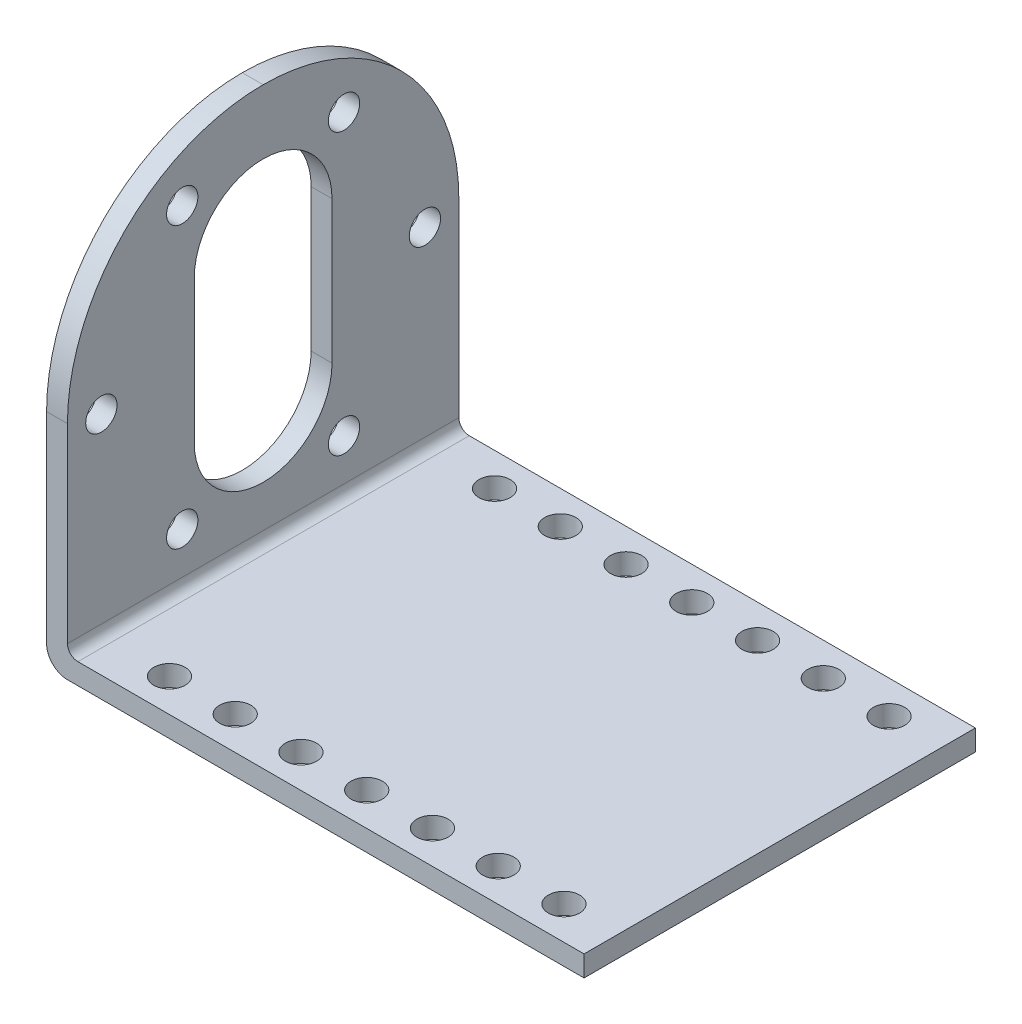
ISO-10303-21;
HEADER;
FILE_DESCRIPTION(('STEP AP214'),'2;1');
FILE_NAME('part.step','',(''),(''),'','','');
FILE_SCHEMA(('AUTOMOTIVE_DESIGN { 1 0 10303 214 1 1 1 1 }'));
ENDSEC;
DATA;
#1=APPLICATION_CONTEXT('core data for automotive mechanical design processes');
#2=APPLICATION_PROTOCOL_DEFINITION('international standard','automotive_design',2000,#1);
#3=PRODUCT_CONTEXT('',#1,'mechanical');
#4=PRODUCT('Part','Part','',(#3));
#5=PRODUCT_RELATED_PRODUCT_CATEGORY('part','',(#4));
#6=PRODUCT_DEFINITION_FORMATION('','',#4);
#7=PRODUCT_DEFINITION_CONTEXT('part definition',#1,'design');
#8=PRODUCT_DEFINITION('design','',#6,#7);
#9=PRODUCT_DEFINITION_SHAPE('','',#8);
#10=(LENGTH_UNIT() NAMED_UNIT(*) SI_UNIT(.MILLI.,.METRE.));
#11=(NAMED_UNIT(*) PLANE_ANGLE_UNIT() SI_UNIT($,.RADIAN.));
#12=(NAMED_UNIT(*) SI_UNIT($,.STERADIAN.) SOLID_ANGLE_UNIT());
#13=UNCERTAINTY_MEASURE_WITH_UNIT(LENGTH_MEASURE(1.E-05),#10,'distance_accuracy_value','');
#14=(GEOMETRIC_REPRESENTATION_CONTEXT(3) GLOBAL_UNCERTAINTY_ASSIGNED_CONTEXT((#13)) GLOBAL_UNIT_ASSIGNED_CONTEXT((#10,
#11,#12)) REPRESENTATION_CONTEXT('',''));
#15=CARTESIAN_POINT('',(0.,0.,0.));
#16=DIRECTION('',(0.,0.,1.));
#17=DIRECTION('',(1.,0.,0.));
#18=AXIS2_PLACEMENT_3D('',#15,#16,#17);
#19=CARTESIAN_POINT('',(-25.75,40.,18.75));
#20=DIRECTION('',(1.,0.,0.));
#21=DIRECTION('',(0.,0.,-1.));
#22=AXIS2_PLACEMENT_3D('',#19,#20,#21);
#23=PLANE('',#22);
#24=CARTESIAN_POINT('',(-25.75,33.8467875173176,-7.75));
#25=DIRECTION('',(-1.,0.,0.));
#26=DIRECTION('',(0.,0.,1.));
#27=AXIS2_PLACEMENT_3D('',#24,#25,#26);
#28=CIRCLE('',#27,1.49999999999999);
#29=CARTESIAN_POINT('',(-25.75,33.8467875173176,-6.25000000000001));
#30=VERTEX_POINT('',#29);
#31=EDGE_CURVE('E347',#30,#30,#28,.T.);
#32=ORIENTED_EDGE('',*,*,#31,.F.);
#33=EDGE_LOOP('',(#32));
#34=FACE_BOUND('',#33,.T.);
#35=CARTESIAN_POINT('',(-25.75,33.8467875173176,7.75000000000001));
#36=DIRECTION('',(-1.,0.,0.));
#37=DIRECTION('',(0.,0.,1.));
#38=AXIS2_PLACEMENT_3D('',#35,#36,#37);
#39=CIRCLE('',#38,1.49999999999999);
#40=CARTESIAN_POINT('',(-25.75,33.8467875173176,9.24999999999999));
#41=VERTEX_POINT('',#40);
#42=EDGE_CURVE('E341',#41,#41,#39,.T.);
#43=ORIENTED_EDGE('',*,*,#42,.F.);
#44=EDGE_LOOP('',(#43));
#45=FACE_BOUND('',#44,.T.);
#46=CARTESIAN_POINT('',(-25.75,20.4233937586588,15.5));
#47=DIRECTION('',(-1.,0.,0.));
#48=DIRECTION('',(0.,0.,1.));
#49=AXIS2_PLACEMENT_3D('',#46,#47,#48);
#50=CIRCLE('',#49,1.49999999999999);
#51=CARTESIAN_POINT('',(-25.75,20.4233937586588,17.));
#52=VERTEX_POINT('',#51);
#53=EDGE_CURVE('E335',#52,#52,#50,.T.);
#54=ORIENTED_EDGE('',*,*,#53,.F.);
#55=EDGE_LOOP('',(#54));
#56=FACE_BOUND('',#55,.T.);
#57=CARTESIAN_POINT('',(-25.75,6.99999999999999,7.75));
#58=DIRECTION('',(-1.,0.,0.));
#59=DIRECTION('',(0.,0.,1.));
#60=AXIS2_PLACEMENT_3D('',#57,#58,#59);
#61=CIRCLE('',#60,1.49999999999999);
#62=CARTESIAN_POINT('',(-25.75,6.99999999999999,9.24999999999999));
#63=VERTEX_POINT('',#62);
#64=EDGE_CURVE('E329',#63,#63,#61,.T.);
#65=ORIENTED_EDGE('',*,*,#64,.F.);
#66=EDGE_LOOP('',(#65));
#67=FACE_BOUND('',#66,.T.);
#68=CARTESIAN_POINT('',(-25.75,7.,-7.75));
#69=DIRECTION('',(-1.,0.,0.));
#70=DIRECTION('',(0.,0.,1.));
#71=AXIS2_PLACEMENT_3D('',#68,#69,#70);
#72=CIRCLE('',#71,1.49999999999999);
#73=CARTESIAN_POINT('',(-25.75,7.,-6.25000000000001));
#74=VERTEX_POINT('',#73);
#75=EDGE_CURVE('E326',#74,#74,#72,.T.);
#76=ORIENTED_EDGE('',*,*,#75,.F.);
#77=EDGE_LOOP('',(#76));
#78=FACE_BOUND('',#77,.T.);
#79=DIRECTION('',(0.,-1.,0.));
#80=VECTOR('',#79,1.);
#81=CARTESIAN_POINT('',(-25.75,27.2467875173176,-6.6));
#82=LINE('',#81,#80);
#83=CARTESIAN_POINT('',(-25.75,27.2467875173176,-6.6));
#84=VERTEX_POINT('',#83);
#85=CARTESIAN_POINT('',(-25.75,13.6,-6.6));
#86=VERTEX_POINT('',#85);
#87=EDGE_CURVE('E142',#84,#86,#82,.T.);
#88=ORIENTED_EDGE('',*,*,#87,.F.);
#89=CARTESIAN_POINT('',(-25.75,27.2467875173176,0.));
#90=DIRECTION('',(-1.,0.,0.));
#91=DIRECTION('',(0.,0.,1.));
#92=AXIS2_PLACEMENT_3D('',#89,#90,#91);
#93=CIRCLE('',#92,6.6);
#94=CARTESIAN_POINT('',(-25.75,27.2467875173176,6.6));
#95=VERTEX_POINT('',#94);
#96=EDGE_CURVE('E147',#95,#84,#93,.T.);
#97=ORIENTED_EDGE('',*,*,#96,.F.);
#98=DIRECTION('',(0.,1.,0.));
#99=VECTOR('',#98,1.);
#100=CARTESIAN_POINT('',(-25.75,27.2467875173176,6.6));
#101=LINE('',#100,#99);
#102=CARTESIAN_POINT('',(-25.75,13.6,6.6));
#103=VERTEX_POINT('',#102);
#104=EDGE_CURVE('E150',#103,#95,#101,.T.);
#105=ORIENTED_EDGE('',*,*,#104,.F.);
#106=CARTESIAN_POINT('',(-25.75,13.6,0.));
#107=DIRECTION('',(-1.,0.,0.));
#108=DIRECTION('',(0.,0.,1.));
#109=AXIS2_PLACEMENT_3D('',#106,#107,#108);
#110=CIRCLE('',#109,6.6);
#111=EDGE_CURVE('E131',#86,#103,#110,.T.);
#112=ORIENTED_EDGE('',*,*,#111,.F.);
#113=EDGE_LOOP('',(#88,#97,#105,#112));
#114=FACE_BOUND('',#113,.T.);
#115=DIRECTION('',(0.,-1.,0.));
#116=VECTOR('',#115,1.);
#117=CARTESIAN_POINT('',(-25.75,40.,18.75));
#118=LINE('',#117,#116);
#119=CARTESIAN_POINT('',(-25.75,21.25,18.75));
#120=VERTEX_POINT('',#119);
#121=CARTESIAN_POINT('',(-25.75,2.,18.75));
#122=VERTEX_POINT('',#121);
#123=EDGE_CURVE('E265',#120,#122,#118,.T.);
#124=ORIENTED_EDGE('',*,*,#123,.F.);
#125=CARTESIAN_POINT('',(-25.75,21.25,0.));
#126=DIRECTION('',(1.,0.,0.));
#127=DIRECTION('',(0.,0.,-1.));
#128=AXIS2_PLACEMENT_3D('',#125,#126,#127);
#129=CIRCLE('',#128,18.75);
#130=CARTESIAN_POINT('',(-25.75,40.,0.));
#131=VERTEX_POINT('',#130);
#132=EDGE_CURVE('E42',#120,#131,#129,.F.);
#133=ORIENTED_EDGE('',*,*,#132,.T.);
#134=CARTESIAN_POINT('',(-25.75,21.25,0.));
#135=DIRECTION('',(1.,0.,0.));
#136=DIRECTION('',(0.,0.,-1.));
#137=AXIS2_PLACEMENT_3D('',#134,#135,#136);
#138=CIRCLE('',#137,18.75);
#139=CARTESIAN_POINT('',(-25.75,21.25,-18.75));
#140=VERTEX_POINT('',#139);
#141=EDGE_CURVE('E53',#131,#140,#138,.F.);
#142=ORIENTED_EDGE('',*,*,#141,.T.);
#143=DIRECTION('',(0.,-1.,0.));
#144=VECTOR('',#143,1.);
#145=CARTESIAN_POINT('',(-25.75,40.,-18.75));
#146=LINE('',#145,#144);
#147=CARTESIAN_POINT('',(-25.75,2.,-18.75));
#148=VERTEX_POINT('',#147);
#149=EDGE_CURVE('E267',#140,#148,#146,.T.);
#150=ORIENTED_EDGE('',*,*,#149,.T.);
#151=DIRECTION('',(0.,0.,1.));
#152=VECTOR('',#151,1.);
#153=CARTESIAN_POINT('',(-25.75,2.,18.75));
#154=LINE('',#153,#152);
#155=EDGE_CURVE('E282',#148,#122,#154,.T.);
#156=ORIENTED_EDGE('',*,*,#155,.T.);
#157=EDGE_LOOP('',(#124,#133,#142,#150,#156));
#158=FACE_BOUND('',#157,.T.);
#159=CARTESIAN_POINT('',(-25.75,20.4233937586588,-15.5));
#160=DIRECTION('',(-1.,0.,0.));
#161=DIRECTION('',(0.,0.,1.));
#162=AXIS2_PLACEMENT_3D('',#159,#160,#161);
#163=CIRCLE('',#162,1.49999999999999);
#164=CARTESIAN_POINT('',(-25.75,20.4233937586588,-14.));
#165=VERTEX_POINT('',#164);
#166=EDGE_CURVE('E316',#165,#165,#163,.T.);
#167=ORIENTED_EDGE('',*,*,#166,.F.);
#168=EDGE_LOOP('',(#167));
#169=FACE_BOUND('',#168,.T.);
#170=ADVANCED_FACE('F33',(#34,#45,#56,#67,#78,#114,#158,#169),#23,.F.);
#171=CARTESIAN_POINT('',(25.75,40.,18.75));
#172=DIRECTION('',(-1.,0.,0.));
#173=DIRECTION('',(0.,0.,1.));
#174=AXIS2_PLACEMENT_3D('',#171,#172,#173);
#175=PLANE('',#174);
#176=DIRECTION('',(0.,-1.,0.));
#177=VECTOR('',#176,1.);
#178=CARTESIAN_POINT('',(25.75,40.,-18.75));
#179=LINE('',#178,#177);
#180=CARTESIAN_POINT('',(25.75,2.,-18.75));
#181=VERTEX_POINT('',#180);
#182=CARTESIAN_POINT('',(25.75,0.,-18.75));
#183=VERTEX_POINT('',#182);
#184=EDGE_CURVE('E269',#181,#183,#179,.T.);
#185=ORIENTED_EDGE('',*,*,#184,.F.);
#186=DIRECTION('',(0.,0.,1.));
#187=VECTOR('',#186,1.);
#188=CARTESIAN_POINT('',(25.75,2.,-18.75));
#189=LINE('',#188,#187);
#190=CARTESIAN_POINT('',(25.75,2.,18.75));
#191=VERTEX_POINT('',#190);
#192=EDGE_CURVE('E249',#181,#191,#189,.T.);
#193=ORIENTED_EDGE('',*,*,#192,.T.);
#194=DIRECTION('',(0.,-1.,0.));
#195=VECTOR('',#194,1.);
#196=CARTESIAN_POINT('',(25.75,40.,18.75));
#197=LINE('',#196,#195);
#198=CARTESIAN_POINT('',(25.75,0.,18.75));
#199=VERTEX_POINT('',#198);
#200=EDGE_CURVE('E262',#191,#199,#197,.T.);
#201=ORIENTED_EDGE('',*,*,#200,.T.);
#202=DIRECTION('',(0.,0.,-1.));
#203=VECTOR('',#202,1.);
#204=CARTESIAN_POINT('',(25.75,0.,18.75));
#205=LINE('',#204,#203);
#206=EDGE_CURVE('E254',#199,#183,#205,.T.);
#207=ORIENTED_EDGE('',*,*,#206,.T.);
#208=EDGE_LOOP('',(#185,#193,#201,#207));
#209=FACE_BOUND('',#208,.T.);
#210=ADVANCED_FACE('F356',(#209),#175,.F.);
#211=CARTESIAN_POINT('',(-25.75,40.,-18.75));
#212=DIRECTION('',(0.,0.,1.));
#213=DIRECTION('',(1.,0.,0.));
#214=AXIS2_PLACEMENT_3D('',#211,#212,#213);
#215=PLANE('',#214);
#216=ORIENTED_EDGE('',*,*,#149,.F.);
#217=DIRECTION('',(-1.,0.,0.));
#218=VECTOR('',#217,1.);
#219=CARTESIAN_POINT('',(-25.75,21.25,-18.75));
#220=LINE('',#219,#218);
#221=CARTESIAN_POINT('',(-23.75,21.25,-18.75));
#222=VERTEX_POINT('',#221);
#223=EDGE_CURVE('E11',#140,#222,#220,.F.);
#224=ORIENTED_EDGE('',*,*,#223,.T.);
#225=DIRECTION('',(0.,-1.,0.));
#226=VECTOR('',#225,1.);
#227=CARTESIAN_POINT('',(-23.75,2.,-18.75));
#228=LINE('',#227,#226);
#229=CARTESIAN_POINT('',(-23.75,3.,-18.75));
#230=VERTEX_POINT('',#229);
#231=EDGE_CURVE('E244',#222,#230,#228,.T.);
#232=ORIENTED_EDGE('',*,*,#231,.T.);
#233=CARTESIAN_POINT('',(-22.75,3.,-18.75));
#234=DIRECTION('',(0.,0.,1.));
#235=DIRECTION('',(1.,0.,0.));
#236=AXIS2_PLACEMENT_3D('',#233,#234,#235);
#237=CIRCLE('',#236,1.);
#238=CARTESIAN_POINT('',(-22.75,2.,-18.75));
#239=VERTEX_POINT('',#238);
#240=EDGE_CURVE('E280',#230,#239,#237,.T.);
#241=ORIENTED_EDGE('',*,*,#240,.T.);
#242=DIRECTION('',(1.,0.,0.));
#243=VECTOR('',#242,1.);
#244=CARTESIAN_POINT('',(-23.75,2.,-18.75));
#245=LINE('',#244,#243);
#246=EDGE_CURVE('E246',#239,#181,#245,.T.);
#247=ORIENTED_EDGE('',*,*,#246,.T.);
#248=ORIENTED_EDGE('',*,*,#184,.T.);
#249=DIRECTION('',(-1.,0.,0.));
#250=VECTOR('',#249,1.);
#251=CARTESIAN_POINT('',(-25.75,0.,-18.75));
#252=LINE('',#251,#250);
#253=CARTESIAN_POINT('',(-23.75,0.,-18.75));
#254=VERTEX_POINT('',#253);
#255=EDGE_CURVE('E257',#183,#254,#252,.T.);
#256=ORIENTED_EDGE('',*,*,#255,.T.);
#257=CARTESIAN_POINT('',(-23.75,2.,-18.75));
#258=DIRECTION('',(0.,0.,1.));
#259=DIRECTION('',(1.,0.,0.));
#260=AXIS2_PLACEMENT_3D('',#257,#258,#259);
#261=CIRCLE('',#260,2.);
#262=EDGE_CURVE('E289',#254,#148,#261,.F.);
#263=ORIENTED_EDGE('',*,*,#262,.T.);
#264=EDGE_LOOP('',(#216,#224,#232,#241,#247,#248,#256,#263));
#265=FACE_BOUND('',#264,.T.);
#266=ADVANCED_FACE('F415',(#265),#215,.F.);
#267=CARTESIAN_POINT('',(-25.75,40.,18.75));
#268=DIRECTION('',(0.,0.,-1.));
#269=DIRECTION('',(-1.,0.,0.));
#270=AXIS2_PLACEMENT_3D('',#267,#268,#269);
#271=PLANE('',#270);
#272=DIRECTION('',(0.,-1.,0.));
#273=VECTOR('',#272,1.);
#274=CARTESIAN_POINT('',(-23.75,2.,18.75));
#275=LINE('',#274,#273);
#276=CARTESIAN_POINT('',(-23.75,21.25,18.75));
#277=VERTEX_POINT('',#276);
#278=CARTESIAN_POINT('',(-23.75,3.,18.75));
#279=VERTEX_POINT('',#278);
#280=EDGE_CURVE('E243',#277,#279,#275,.T.);
#281=ORIENTED_EDGE('',*,*,#280,.F.);
#282=DIRECTION('',(1.,0.,0.));
#283=VECTOR('',#282,1.);
#284=CARTESIAN_POINT('',(-25.75,21.25,18.75));
#285=LINE('',#284,#283);
#286=EDGE_CURVE('E305',#277,#120,#285,.F.);
#287=ORIENTED_EDGE('',*,*,#286,.T.);
#288=ORIENTED_EDGE('',*,*,#123,.T.);
#289=CARTESIAN_POINT('',(-23.75,2.,18.75));
#290=DIRECTION('',(0.,0.,-1.));
#291=DIRECTION('',(-1.,0.,0.));
#292=AXIS2_PLACEMENT_3D('',#289,#290,#291);
#293=CIRCLE('',#292,2.);
#294=CARTESIAN_POINT('',(-23.75,0.,18.75));
#295=VERTEX_POINT('',#294);
#296=EDGE_CURVE('E285',#122,#295,#293,.F.);
#297=ORIENTED_EDGE('',*,*,#296,.T.);
#298=DIRECTION('',(1.,0.,0.));
#299=VECTOR('',#298,1.);
#300=CARTESIAN_POINT('',(-25.75,0.,18.75));
#301=LINE('',#300,#299);
#302=EDGE_CURVE('E260',#295,#199,#301,.T.);
#303=ORIENTED_EDGE('',*,*,#302,.T.);
#304=ORIENTED_EDGE('',*,*,#200,.F.);
#305=DIRECTION('',(1.,0.,0.));
#306=VECTOR('',#305,1.);
#307=CARTESIAN_POINT('',(-23.75,2.,18.75));
#308=LINE('',#307,#306);
#309=CARTESIAN_POINT('',(-22.75,2.,18.75));
#310=VERTEX_POINT('',#309);
#311=EDGE_CURVE('E247',#310,#191,#308,.T.);
#312=ORIENTED_EDGE('',*,*,#311,.F.);
#313=CARTESIAN_POINT('',(-22.75,3.,18.75));
#314=DIRECTION('',(0.,0.,-1.));
#315=DIRECTION('',(-1.,0.,0.));
#316=AXIS2_PLACEMENT_3D('',#313,#314,#315);
#317=CIRCLE('',#316,1.);
#318=EDGE_CURVE('E277',#310,#279,#317,.T.);
#319=ORIENTED_EDGE('',*,*,#318,.T.);
#320=EDGE_LOOP('',(#281,#287,#288,#297,#303,#304,#312,#319));
#321=FACE_BOUND('',#320,.T.);
#322=ADVANCED_FACE('F390',(#321),#271,.F.);
#323=CARTESIAN_POINT('',(0.,0.,0.));
#324=DIRECTION('',(0.,-1.,0.));
#325=DIRECTION('',(0.,0.,-1.));
#326=AXIS2_PLACEMENT_3D('',#323,#324,#325);
#327=PLANE('',#326);
#328=CARTESIAN_POINT('',(-17.15,0.,15.575));
#329=DIRECTION('',(0.,1.,0.));
#330=DIRECTION('',(0.,0.,1.));
#331=AXIS2_PLACEMENT_3D('',#328,#329,#330);
#332=CIRCLE('',#331,1.5);
#333=CARTESIAN_POINT('',(-17.15,0.,17.075));
#334=VERTEX_POINT('',#333);
#335=EDGE_CURVE('E162',#334,#334,#332,.T.);
#336=ORIENTED_EDGE('',*,*,#335,.T.);
#337=EDGE_LOOP('',(#336));
#338=FACE_BOUND('',#337,.T.);
#339=CARTESIAN_POINT('',(-17.15,0.,-15.575));
#340=DIRECTION('',(0.,1.,0.));
#341=DIRECTION('',(0.,0.,1.));
#342=AXIS2_PLACEMENT_3D('',#339,#340,#341);
#343=CIRCLE('',#342,1.5);
#344=CARTESIAN_POINT('',(-17.15,0.,-14.075));
#345=VERTEX_POINT('',#344);
#346=EDGE_CURVE('E168',#345,#345,#343,.T.);
#347=ORIENTED_EDGE('',*,*,#346,.T.);
#348=EDGE_LOOP('',(#347));
#349=FACE_BOUND('',#348,.T.);
#350=CARTESIAN_POINT('',(-10.85,0.,15.575));
#351=DIRECTION('',(0.,1.,0.));
#352=DIRECTION('',(0.,0.,1.));
#353=AXIS2_PLACEMENT_3D('',#350,#351,#352);
#354=CIRCLE('',#353,1.5);
#355=CARTESIAN_POINT('',(-10.85,0.,17.075));
#356=VERTEX_POINT('',#355);
#357=EDGE_CURVE('E174',#356,#356,#354,.T.);
#358=ORIENTED_EDGE('',*,*,#357,.T.);
#359=EDGE_LOOP('',(#358));
#360=FACE_BOUND('',#359,.T.);
#361=CARTESIAN_POINT('',(-4.54999999999999,0.,15.575));
#362=DIRECTION('',(0.,1.,0.));
#363=DIRECTION('',(0.,0.,1.));
#364=AXIS2_PLACEMENT_3D('',#361,#362,#363);
#365=CIRCLE('',#364,1.5);
#366=CARTESIAN_POINT('',(-4.54999999999999,0.,17.075));
#367=VERTEX_POINT('',#366);
#368=EDGE_CURVE('E180',#367,#367,#365,.T.);
#369=ORIENTED_EDGE('',*,*,#368,.T.);
#370=EDGE_LOOP('',(#369));
#371=FACE_BOUND('',#370,.T.);
#372=CARTESIAN_POINT('',(1.75000000000001,0.,15.575));
#373=DIRECTION('',(0.,1.,0.));
#374=DIRECTION('',(0.,0.,1.));
#375=AXIS2_PLACEMENT_3D('',#372,#373,#374);
#376=CIRCLE('',#375,1.5);
#377=CARTESIAN_POINT('',(1.75000000000001,0.,17.075));
#378=VERTEX_POINT('',#377);
#379=EDGE_CURVE('E186',#378,#378,#376,.T.);
#380=ORIENTED_EDGE('',*,*,#379,.T.);
#381=EDGE_LOOP('',(#380));
#382=FACE_BOUND('',#381,.T.);
#383=CARTESIAN_POINT('',(8.05000000000001,0.,15.575));
#384=DIRECTION('',(0.,1.,0.));
#385=DIRECTION('',(0.,0.,1.));
#386=AXIS2_PLACEMENT_3D('',#383,#384,#385);
#387=CIRCLE('',#386,1.5);
#388=CARTESIAN_POINT('',(8.05000000000001,0.,17.075));
#389=VERTEX_POINT('',#388);
#390=EDGE_CURVE('E192',#389,#389,#387,.T.);
#391=ORIENTED_EDGE('',*,*,#390,.T.);
#392=EDGE_LOOP('',(#391));
#393=FACE_BOUND('',#392,.T.);
#394=CARTESIAN_POINT('',(14.35,0.,15.575));
#395=DIRECTION('',(0.,1.,0.));
#396=DIRECTION('',(0.,0.,1.));
#397=AXIS2_PLACEMENT_3D('',#394,#395,#396);
#398=CIRCLE('',#397,1.5);
#399=CARTESIAN_POINT('',(14.35,0.,17.075));
#400=VERTEX_POINT('',#399);
#401=EDGE_CURVE('E198',#400,#400,#398,.T.);
#402=ORIENTED_EDGE('',*,*,#401,.T.);
#403=EDGE_LOOP('',(#402));
#404=FACE_BOUND('',#403,.T.);
#405=CARTESIAN_POINT('',(20.65,0.,15.575));
#406=DIRECTION('',(0.,1.,0.));
#407=DIRECTION('',(0.,0.,1.));
#408=AXIS2_PLACEMENT_3D('',#405,#406,#407);
#409=CIRCLE('',#408,1.5);
#410=CARTESIAN_POINT('',(20.65,0.,17.075));
#411=VERTEX_POINT('',#410);
#412=EDGE_CURVE('E204',#411,#411,#409,.T.);
#413=ORIENTED_EDGE('',*,*,#412,.T.);
#414=EDGE_LOOP('',(#413));
#415=FACE_BOUND('',#414,.T.);
#416=CARTESIAN_POINT('',(20.65,0.,-15.575));
#417=DIRECTION('',(0.,1.,0.));
#418=DIRECTION('',(0.,0.,1.));
#419=AXIS2_PLACEMENT_3D('',#416,#417,#418);
#420=CIRCLE('',#419,1.5);
#421=CARTESIAN_POINT('',(20.65,0.,-14.075));
#422=VERTEX_POINT('',#421);
#423=EDGE_CURVE('E210',#422,#422,#420,.T.);
#424=ORIENTED_EDGE('',*,*,#423,.T.);
#425=EDGE_LOOP('',(#424));
#426=FACE_BOUND('',#425,.T.);
#427=CARTESIAN_POINT('',(14.35,0.,-15.575));
#428=DIRECTION('',(0.,1.,0.));
#429=DIRECTION('',(0.,0.,1.));
#430=AXIS2_PLACEMENT_3D('',#427,#428,#429);
#431=CIRCLE('',#430,1.5);
#432=CARTESIAN_POINT('',(14.35,0.,-14.075));
#433=VERTEX_POINT('',#432);
#434=EDGE_CURVE('E216',#433,#433,#431,.T.);
#435=ORIENTED_EDGE('',*,*,#434,.T.);
#436=EDGE_LOOP('',(#435));
#437=FACE_BOUND('',#436,.T.);
#438=CARTESIAN_POINT('',(8.05000000000001,0.,-15.575));
#439=DIRECTION('',(0.,1.,0.));
#440=DIRECTION('',(0.,0.,1.));
#441=AXIS2_PLACEMENT_3D('',#438,#439,#440);
#442=CIRCLE('',#441,1.5);
#443=CARTESIAN_POINT('',(8.05000000000001,0.,-14.075));
#444=VERTEX_POINT('',#443);
#445=EDGE_CURVE('E222',#444,#444,#442,.T.);
#446=ORIENTED_EDGE('',*,*,#445,.T.);
#447=EDGE_LOOP('',(#446));
#448=FACE_BOUND('',#447,.T.);
#449=CARTESIAN_POINT('',(1.75000000000001,0.,-15.575));
#450=DIRECTION('',(0.,1.,0.));
#451=DIRECTION('',(0.,0.,1.));
#452=AXIS2_PLACEMENT_3D('',#449,#450,#451);
#453=CIRCLE('',#452,1.5);
#454=CARTESIAN_POINT('',(1.75000000000001,0.,-14.075));
#455=VERTEX_POINT('',#454);
#456=EDGE_CURVE('E228',#455,#455,#453,.T.);
#457=ORIENTED_EDGE('',*,*,#456,.T.);
#458=EDGE_LOOP('',(#457));
#459=FACE_BOUND('',#458,.T.);
#460=CARTESIAN_POINT('',(-4.54999999999999,0.,-15.575));
#461=DIRECTION('',(0.,1.,0.));
#462=DIRECTION('',(0.,0.,1.));
#463=AXIS2_PLACEMENT_3D('',#460,#461,#462);
#464=CIRCLE('',#463,1.5);
#465=CARTESIAN_POINT('',(-4.54999999999999,0.,-14.075));
#466=VERTEX_POINT('',#465);
#467=EDGE_CURVE('E234',#466,#466,#464,.T.);
#468=ORIENTED_EDGE('',*,*,#467,.T.);
#469=EDGE_LOOP('',(#468));
#470=FACE_BOUND('',#469,.T.);
#471=CARTESIAN_POINT('',(-10.85,0.,-15.575));
#472=DIRECTION('',(0.,1.,0.));
#473=DIRECTION('',(0.,0.,1.));
#474=AXIS2_PLACEMENT_3D('',#471,#472,#473);
#475=CIRCLE('',#474,1.5);
#476=CARTESIAN_POINT('',(-10.85,0.,-14.075));
#477=VERTEX_POINT('',#476);
#478=EDGE_CURVE('E240',#477,#477,#475,.T.);
#479=ORIENTED_EDGE('',*,*,#478,.T.);
#480=EDGE_LOOP('',(#479));
#481=FACE_BOUND('',#480,.T.);
#482=ORIENTED_EDGE('',*,*,#302,.F.);
#483=DIRECTION('',(0.,0.,1.));
#484=VECTOR('',#483,1.);
#485=CARTESIAN_POINT('',(-23.75,0.,-18.75));
#486=LINE('',#485,#484);
#487=EDGE_CURVE('E287',#295,#254,#486,.F.);
#488=ORIENTED_EDGE('',*,*,#487,.T.);
#489=ORIENTED_EDGE('',*,*,#255,.F.);
#490=ORIENTED_EDGE('',*,*,#206,.F.);
#491=EDGE_LOOP('',(#482,#488,#489,#490));
#492=FACE_BOUND('',#491,.T.);
#493=ADVANCED_FACE('F377',(#338,#349,#360,#371,#382,#393,#404,#415,#426,#437,#448,#459,#470,
#481,#492),#327,.T.);
#494=CARTESIAN_POINT('',(-23.75,2.,-18.75));
#495=DIRECTION('',(-1.,0.,0.));
#496=DIRECTION('',(0.,0.,1.));
#497=AXIS2_PLACEMENT_3D('',#494,#495,#496);
#498=PLANE('',#497);
#499=CARTESIAN_POINT('',(-23.75,33.8467875173176,-7.75));
#500=DIRECTION('',(-1.,0.,0.));
#501=DIRECTION('',(0.,0.,1.));
#502=AXIS2_PLACEMENT_3D('',#499,#500,#501);
#503=CIRCLE('',#502,1.49999999999999);
#504=CARTESIAN_POINT('',(-23.75,33.8467875173176,-6.25));
#505=VERTEX_POINT('',#504);
#506=EDGE_CURVE('E344',#505,#505,#503,.T.);
#507=ORIENTED_EDGE('',*,*,#506,.T.);
#508=EDGE_LOOP('',(#507));
#509=FACE_BOUND('',#508,.T.);
#510=CARTESIAN_POINT('',(-23.75,33.8467875173176,7.75000000000001));
#511=DIRECTION('',(-1.,0.,0.));
#512=DIRECTION('',(0.,0.,1.));
#513=AXIS2_PLACEMENT_3D('',#510,#511,#512);
#514=CIRCLE('',#513,1.49999999999999);
#515=CARTESIAN_POINT('',(-23.75,33.8467875173176,9.25));
#516=VERTEX_POINT('',#515);
#517=EDGE_CURVE('E338',#516,#516,#514,.T.);
#518=ORIENTED_EDGE('',*,*,#517,.T.);
#519=EDGE_LOOP('',(#518));
#520=FACE_BOUND('',#519,.T.);
#521=CARTESIAN_POINT('',(-23.75,20.4233937586588,15.5));
#522=DIRECTION('',(-1.,0.,0.));
#523=DIRECTION('',(0.,0.,1.));
#524=AXIS2_PLACEMENT_3D('',#521,#522,#523);
#525=CIRCLE('',#524,1.49999999999999);
#526=CARTESIAN_POINT('',(-23.75,20.4233937586588,17.));
#527=VERTEX_POINT('',#526);
#528=EDGE_CURVE('E332',#527,#527,#525,.T.);
#529=ORIENTED_EDGE('',*,*,#528,.T.);
#530=EDGE_LOOP('',(#529));
#531=FACE_BOUND('',#530,.T.);
#532=CARTESIAN_POINT('',(-23.75,6.99999999999999,7.75));
#533=DIRECTION('',(-1.,0.,0.));
#534=DIRECTION('',(0.,0.,1.));
#535=AXIS2_PLACEMENT_3D('',#532,#533,#534);
#536=CIRCLE('',#535,1.49999999999999);
#537=CARTESIAN_POINT('',(-23.75,6.99999999999999,9.24999999999999));
#538=VERTEX_POINT('',#537);
#539=EDGE_CURVE('E37',#538,#538,#536,.T.);
#540=ORIENTED_EDGE('',*,*,#539,.T.);
#541=EDGE_LOOP('',(#540));
#542=FACE_BOUND('',#541,.T.);
#543=CARTESIAN_POINT('',(-23.75,7.,-7.75));
#544=DIRECTION('',(-1.,0.,0.));
#545=DIRECTION('',(0.,0.,1.));
#546=AXIS2_PLACEMENT_3D('',#543,#544,#545);
#547=CIRCLE('',#546,1.49999999999999);
#548=CARTESIAN_POINT('',(-23.75,7.,-6.25000000000001));
#549=VERTEX_POINT('',#548);
#550=EDGE_CURVE('E321',#549,#549,#547,.T.);
#551=ORIENTED_EDGE('',*,*,#550,.T.);
#552=EDGE_LOOP('',(#551));
#553=FACE_BOUND('',#552,.T.);
#554=CARTESIAN_POINT('',(-23.75,20.4233937586588,-15.5));
#555=DIRECTION('',(-1.,0.,0.));
#556=DIRECTION('',(0.,0.,1.));
#557=AXIS2_PLACEMENT_3D('',#554,#555,#556);
#558=CIRCLE('',#557,1.49999999999999);
#559=CARTESIAN_POINT('',(-23.75,20.4233937586588,-14.));
#560=VERTEX_POINT('',#559);
#561=EDGE_CURVE('E311',#560,#560,#558,.T.);
#562=ORIENTED_EDGE('',*,*,#561,.T.);
#563=EDGE_LOOP('',(#562));
#564=FACE_BOUND('',#563,.T.);
#565=DIRECTION('',(0.,1.,0.));
#566=VECTOR('',#565,1.);
#567=CARTESIAN_POINT('',(-23.75,2.,6.6));
#568=LINE('',#567,#566);
#569=CARTESIAN_POINT('',(-23.75,13.6,6.6));
#570=VERTEX_POINT('',#569);
#571=CARTESIAN_POINT('',(-23.75,27.2467875173176,6.6));
#572=VERTEX_POINT('',#571);
#573=EDGE_CURVE('E295',#570,#572,#568,.T.);
#574=ORIENTED_EDGE('',*,*,#573,.T.);
#575=CARTESIAN_POINT('',(-23.75,27.2467875173176,0.));
#576=DIRECTION('',(-1.,0.,0.));
#577=DIRECTION('',(0.,0.,1.));
#578=AXIS2_PLACEMENT_3D('',#575,#576,#577);
#579=CIRCLE('',#578,6.6);
#580=CARTESIAN_POINT('',(-23.75,27.2467875173176,-6.6));
#581=VERTEX_POINT('',#580);
#582=EDGE_CURVE('E298',#572,#581,#579,.T.);
#583=ORIENTED_EDGE('',*,*,#582,.T.);
#584=DIRECTION('',(0.,-1.,0.));
#585=VECTOR('',#584,1.);
#586=CARTESIAN_POINT('',(-23.75,2.,-6.6));
#587=LINE('',#586,#585);
#588=CARTESIAN_POINT('',(-23.75,13.6,-6.6));
#589=VERTEX_POINT('',#588);
#590=EDGE_CURVE('E292',#581,#589,#587,.T.);
#591=ORIENTED_EDGE('',*,*,#590,.T.);
#592=CARTESIAN_POINT('',(-23.75,13.6,0.));
#593=DIRECTION('',(-1.,0.,0.));
#594=DIRECTION('',(0.,0.,1.));
#595=AXIS2_PLACEMENT_3D('',#592,#593,#594);
#596=CIRCLE('',#595,6.6);
#597=EDGE_CURVE('E134',#589,#570,#596,.T.);
#598=ORIENTED_EDGE('',*,*,#597,.T.);
#599=EDGE_LOOP('',(#574,#583,#591,#598));
#600=FACE_BOUND('',#599,.T.);
#601=CARTESIAN_POINT('',(-23.75,21.25,0.));
#602=DIRECTION('',(-1.,0.,0.));
#603=DIRECTION('',(0.,0.,1.));
#604=AXIS2_PLACEMENT_3D('',#601,#602,#603);
#605=CIRCLE('',#604,18.75);
#606=CARTESIAN_POINT('',(-23.75,40.,0.));
#607=VERTEX_POINT('',#606);
#608=EDGE_CURVE('E301',#222,#607,#605,.F.);
#609=ORIENTED_EDGE('',*,*,#608,.T.);
#610=CARTESIAN_POINT('',(-23.75,21.25,0.));
#611=DIRECTION('',(-1.,0.,0.));
#612=DIRECTION('',(0.,0.,1.));
#613=AXIS2_PLACEMENT_3D('',#610,#611,#612);
#614=CIRCLE('',#613,18.75);
#615=EDGE_CURVE('E303',#607,#277,#614,.F.);
#616=ORIENTED_EDGE('',*,*,#615,.T.);
#617=ORIENTED_EDGE('',*,*,#280,.T.);
#618=DIRECTION('',(0.,0.,1.));
#619=VECTOR('',#618,1.);
#620=CARTESIAN_POINT('',(-23.75,3.,-18.75));
#621=LINE('',#620,#619);
#622=EDGE_CURVE('E274',#279,#230,#621,.F.);
#623=ORIENTED_EDGE('',*,*,#622,.T.);
#624=ORIENTED_EDGE('',*,*,#231,.F.);
#625=EDGE_LOOP('',(#609,#616,#617,#623,#624));
#626=FACE_BOUND('',#625,.T.);
#627=ADVANCED_FACE('F374',(#509,#520,#531,#542,#553,#564,#600,#626),#498,.F.);
#628=CARTESIAN_POINT('',(-23.75,2.,-18.75));
#629=DIRECTION('',(0.,-1.,0.));
#630=DIRECTION('',(0.,0.,-1.));
#631=AXIS2_PLACEMENT_3D('',#628,#629,#630);
#632=PLANE('',#631);
#633=CARTESIAN_POINT('',(-17.15,2.,15.575));
#634=DIRECTION('',(0.,1.,0.));
#635=DIRECTION('',(0.,0.,1.));
#636=AXIS2_PLACEMENT_3D('',#633,#634,#635);
#637=CIRCLE('',#636,1.5);
#638=CARTESIAN_POINT('',(-17.15,2.,17.075));
#639=VERTEX_POINT('',#638);
#640=EDGE_CURVE('E157',#639,#639,#637,.T.);
#641=ORIENTED_EDGE('',*,*,#640,.F.);
#642=EDGE_LOOP('',(#641));
#643=FACE_BOUND('',#642,.T.);
#644=CARTESIAN_POINT('',(-17.15,2.,-15.575));
#645=DIRECTION('',(0.,1.,0.));
#646=DIRECTION('',(0.,0.,1.));
#647=AXIS2_PLACEMENT_3D('',#644,#645,#646);
#648=CIRCLE('',#647,1.5);
#649=CARTESIAN_POINT('',(-17.15,2.,-14.075));
#650=VERTEX_POINT('',#649);
#651=EDGE_CURVE('E165',#650,#650,#648,.T.);
#652=ORIENTED_EDGE('',*,*,#651,.F.);
#653=EDGE_LOOP('',(#652));
#654=FACE_BOUND('',#653,.T.);
#655=CARTESIAN_POINT('',(-10.85,2.,15.575));
#656=DIRECTION('',(0.,1.,0.));
#657=DIRECTION('',(0.,0.,1.));
#658=AXIS2_PLACEMENT_3D('',#655,#656,#657);
#659=CIRCLE('',#658,1.5);
#660=CARTESIAN_POINT('',(-10.85,2.,17.075));
#661=VERTEX_POINT('',#660);
#662=EDGE_CURVE('E171',#661,#661,#659,.T.);
#663=ORIENTED_EDGE('',*,*,#662,.F.);
#664=EDGE_LOOP('',(#663));
#665=FACE_BOUND('',#664,.T.);
#666=CARTESIAN_POINT('',(-4.54999999999999,2.,15.575));
#667=DIRECTION('',(0.,1.,0.));
#668=DIRECTION('',(0.,0.,1.));
#669=AXIS2_PLACEMENT_3D('',#666,#667,#668);
#670=CIRCLE('',#669,1.5);
#671=CARTESIAN_POINT('',(-4.54999999999999,2.,17.075));
#672=VERTEX_POINT('',#671);
#673=EDGE_CURVE('E177',#672,#672,#670,.T.);
#674=ORIENTED_EDGE('',*,*,#673,.F.);
#675=EDGE_LOOP('',(#674));
#676=FACE_BOUND('',#675,.T.);
#677=CARTESIAN_POINT('',(1.75000000000001,2.,15.575));
#678=DIRECTION('',(0.,1.,0.));
#679=DIRECTION('',(0.,0.,1.));
#680=AXIS2_PLACEMENT_3D('',#677,#678,#679);
#681=CIRCLE('',#680,1.5);
#682=CARTESIAN_POINT('',(1.75000000000001,2.,17.075));
#683=VERTEX_POINT('',#682);
#684=EDGE_CURVE('E183',#683,#683,#681,.T.);
#685=ORIENTED_EDGE('',*,*,#684,.F.);
#686=EDGE_LOOP('',(#685));
#687=FACE_BOUND('',#686,.T.);
#688=CARTESIAN_POINT('',(8.05000000000001,2.,15.575));
#689=DIRECTION('',(0.,1.,0.));
#690=DIRECTION('',(0.,0.,1.));
#691=AXIS2_PLACEMENT_3D('',#688,#689,#690);
#692=CIRCLE('',#691,1.5);
#693=CARTESIAN_POINT('',(8.05000000000001,2.,17.075));
#694=VERTEX_POINT('',#693);
#695=EDGE_CURVE('E189',#694,#694,#692,.T.);
#696=ORIENTED_EDGE('',*,*,#695,.F.);
#697=EDGE_LOOP('',(#696));
#698=FACE_BOUND('',#697,.T.);
#699=CARTESIAN_POINT('',(14.35,2.,15.575));
#700=DIRECTION('',(0.,1.,0.));
#701=DIRECTION('',(0.,0.,1.));
#702=AXIS2_PLACEMENT_3D('',#699,#700,#701);
#703=CIRCLE('',#702,1.5);
#704=CARTESIAN_POINT('',(14.35,2.,17.075));
#705=VERTEX_POINT('',#704);
#706=EDGE_CURVE('E195',#705,#705,#703,.T.);
#707=ORIENTED_EDGE('',*,*,#706,.F.);
#708=EDGE_LOOP('',(#707));
#709=FACE_BOUND('',#708,.T.);
#710=CARTESIAN_POINT('',(20.65,2.,15.575));
#711=DIRECTION('',(0.,1.,0.));
#712=DIRECTION('',(0.,0.,1.));
#713=AXIS2_PLACEMENT_3D('',#710,#711,#712);
#714=CIRCLE('',#713,1.5);
#715=CARTESIAN_POINT('',(20.65,2.,17.075));
#716=VERTEX_POINT('',#715);
#717=EDGE_CURVE('E201',#716,#716,#714,.T.);
#718=ORIENTED_EDGE('',*,*,#717,.F.);
#719=EDGE_LOOP('',(#718));
#720=FACE_BOUND('',#719,.T.);
#721=CARTESIAN_POINT('',(20.65,2.,-15.575));
#722=DIRECTION('',(0.,1.,0.));
#723=DIRECTION('',(0.,0.,1.));
#724=AXIS2_PLACEMENT_3D('',#721,#722,#723);
#725=CIRCLE('',#724,1.5);
#726=CARTESIAN_POINT('',(20.65,2.,-14.075));
#727=VERTEX_POINT('',#726);
#728=EDGE_CURVE('E207',#727,#727,#725,.T.);
#729=ORIENTED_EDGE('',*,*,#728,.F.);
#730=EDGE_LOOP('',(#729));
#731=FACE_BOUND('',#730,.T.);
#732=CARTESIAN_POINT('',(14.35,2.,-15.575));
#733=DIRECTION('',(0.,1.,0.));
#734=DIRECTION('',(0.,0.,1.));
#735=AXIS2_PLACEMENT_3D('',#732,#733,#734);
#736=CIRCLE('',#735,1.5);
#737=CARTESIAN_POINT('',(14.35,2.,-14.075));
#738=VERTEX_POINT('',#737);
#739=EDGE_CURVE('E213',#738,#738,#736,.T.);
#740=ORIENTED_EDGE('',*,*,#739,.F.);
#741=EDGE_LOOP('',(#740));
#742=FACE_BOUND('',#741,.T.);
#743=CARTESIAN_POINT('',(8.05000000000001,2.,-15.575));
#744=DIRECTION('',(0.,1.,0.));
#745=DIRECTION('',(0.,0.,1.));
#746=AXIS2_PLACEMENT_3D('',#743,#744,#745);
#747=CIRCLE('',#746,1.5);
#748=CARTESIAN_POINT('',(8.05000000000001,2.,-14.075));
#749=VERTEX_POINT('',#748);
#750=EDGE_CURVE('E219',#749,#749,#747,.T.);
#751=ORIENTED_EDGE('',*,*,#750,.F.);
#752=EDGE_LOOP('',(#751));
#753=FACE_BOUND('',#752,.T.);
#754=CARTESIAN_POINT('',(1.75000000000001,2.,-15.575));
#755=DIRECTION('',(0.,1.,0.));
#756=DIRECTION('',(0.,0.,1.));
#757=AXIS2_PLACEMENT_3D('',#754,#755,#756);
#758=CIRCLE('',#757,1.5);
#759=CARTESIAN_POINT('',(1.75000000000001,2.,-14.075));
#760=VERTEX_POINT('',#759);
#761=EDGE_CURVE('E225',#760,#760,#758,.T.);
#762=ORIENTED_EDGE('',*,*,#761,.F.);
#763=EDGE_LOOP('',(#762));
#764=FACE_BOUND('',#763,.T.);
#765=CARTESIAN_POINT('',(-4.54999999999999,2.,-15.575));
#766=DIRECTION('',(0.,1.,0.));
#767=DIRECTION('',(0.,0.,1.));
#768=AXIS2_PLACEMENT_3D('',#765,#766,#767);
#769=CIRCLE('',#768,1.5);
#770=CARTESIAN_POINT('',(-4.54999999999999,2.,-14.075));
#771=VERTEX_POINT('',#770);
#772=EDGE_CURVE('E231',#771,#771,#769,.T.);
#773=ORIENTED_EDGE('',*,*,#772,.F.);
#774=EDGE_LOOP('',(#773));
#775=FACE_BOUND('',#774,.T.);
#776=CARTESIAN_POINT('',(-10.85,2.,-15.575));
#777=DIRECTION('',(0.,1.,0.));
#778=DIRECTION('',(0.,0.,1.));
#779=AXIS2_PLACEMENT_3D('',#776,#777,#778);
#780=CIRCLE('',#779,1.5);
#781=CARTESIAN_POINT('',(-10.85,2.,-14.075));
#782=VERTEX_POINT('',#781);
#783=EDGE_CURVE('E237',#782,#782,#780,.T.);
#784=ORIENTED_EDGE('',*,*,#783,.F.);
#785=EDGE_LOOP('',(#784));
#786=FACE_BOUND('',#785,.T.);
#787=ORIENTED_EDGE('',*,*,#246,.F.);
#788=DIRECTION('',(0.,0.,1.));
#789=VECTOR('',#788,1.);
#790=CARTESIAN_POINT('',(-22.75,2.,18.75));
#791=LINE('',#790,#789);
#792=EDGE_CURVE('E271',#239,#310,#791,.T.);
#793=ORIENTED_EDGE('',*,*,#792,.T.);
#794=ORIENTED_EDGE('',*,*,#311,.T.);
#795=ORIENTED_EDGE('',*,*,#192,.F.);
#796=EDGE_LOOP('',(#787,#793,#794,#795));
#797=FACE_BOUND('',#796,.T.);
#798=ADVANCED_FACE('F376',(#643,#654,#665,#676,#687,#698,#709,#720,#731,#742,#753,#764,#775,
#786,#797),#632,.F.);
#799=CARTESIAN_POINT('',(-22.75,3.,-18.75));
#800=DIRECTION('',(0.,0.,-1.));
#801=DIRECTION('',(-1.,0.,0.));
#802=AXIS2_PLACEMENT_3D('',#799,#800,#801);
#803=CYLINDRICAL_SURFACE('',#802,1.);
#804=ORIENTED_EDGE('',*,*,#240,.F.);
#805=ORIENTED_EDGE('',*,*,#622,.F.);
#806=ORIENTED_EDGE('',*,*,#318,.F.);
#807=ORIENTED_EDGE('',*,*,#792,.F.);
#808=EDGE_LOOP('',(#804,#805,#806,#807));
#809=FACE_BOUND('',#808,.T.);
#810=ADVANCED_FACE('F413',(#809),#803,.F.);
#811=CARTESIAN_POINT('',(-23.75,2.,18.75));
#812=DIRECTION('',(0.,0.,-1.));
#813=DIRECTION('',(-1.,0.,0.));
#814=AXIS2_PLACEMENT_3D('',#811,#812,#813);
#815=CYLINDRICAL_SURFACE('',#814,2.);
#816=ORIENTED_EDGE('',*,*,#262,.F.);
#817=ORIENTED_EDGE('',*,*,#487,.F.);
#818=ORIENTED_EDGE('',*,*,#296,.F.);
#819=ORIENTED_EDGE('',*,*,#155,.F.);
#820=EDGE_LOOP('',(#816,#817,#818,#819));
#821=FACE_BOUND('',#820,.T.);
#822=ADVANCED_FACE('F396',(#821),#815,.T.);
#823=CARTESIAN_POINT('',(-10.85,2.,-15.575));
#824=DIRECTION('',(0.,1.,0.));
#825=DIRECTION('',(0.,0.,1.));
#826=AXIS2_PLACEMENT_3D('',#823,#824,#825);
#827=CYLINDRICAL_SURFACE('',#826,1.5);
#828=ORIENTED_EDGE('',*,*,#478,.F.);
#829=EDGE_LOOP('',(#828));
#830=FACE_BOUND('',#829,.T.);
#831=ORIENTED_EDGE('',*,*,#783,.T.);
#832=EDGE_LOOP('',(#831));
#833=FACE_BOUND('',#832,.T.);
#834=ADVANCED_FACE('F429',(#830,#833),#827,.F.);
#835=CARTESIAN_POINT('',(-4.54999999999999,2.,-15.575));
#836=DIRECTION('',(0.,1.,0.));
#837=DIRECTION('',(0.,0.,1.));
#838=AXIS2_PLACEMENT_3D('',#835,#836,#837);
#839=CYLINDRICAL_SURFACE('',#838,1.5);
#840=ORIENTED_EDGE('',*,*,#467,.F.);
#841=EDGE_LOOP('',(#840));
#842=FACE_BOUND('',#841,.T.);
#843=ORIENTED_EDGE('',*,*,#772,.T.);
#844=EDGE_LOOP('',(#843));
#845=FACE_BOUND('',#844,.T.);
#846=ADVANCED_FACE('F499',(#842,#845),#839,.F.);
#847=CARTESIAN_POINT('',(1.75000000000001,2.,-15.575));
#848=DIRECTION('',(0.,1.,0.));
#849=DIRECTION('',(0.,0.,1.));
#850=AXIS2_PLACEMENT_3D('',#847,#848,#849);
#851=CYLINDRICAL_SURFACE('',#850,1.5);
#852=ORIENTED_EDGE('',*,*,#456,.F.);
#853=EDGE_LOOP('',(#852));
#854=FACE_BOUND('',#853,.T.);
#855=ORIENTED_EDGE('',*,*,#761,.T.);
#856=EDGE_LOOP('',(#855));
#857=FACE_BOUND('',#856,.T.);
#858=ADVANCED_FACE('F495',(#854,#857),#851,.F.);
#859=CARTESIAN_POINT('',(8.05000000000001,2.,-15.575));
#860=DIRECTION('',(0.,1.,0.));
#861=DIRECTION('',(0.,0.,1.));
#862=AXIS2_PLACEMENT_3D('',#859,#860,#861);
#863=CYLINDRICAL_SURFACE('',#862,1.5);
#864=ORIENTED_EDGE('',*,*,#445,.F.);
#865=EDGE_LOOP('',(#864));
#866=FACE_BOUND('',#865,.T.);
#867=ORIENTED_EDGE('',*,*,#750,.T.);
#868=EDGE_LOOP('',(#867));
#869=FACE_BOUND('',#868,.T.);
#870=ADVANCED_FACE('F491',(#866,#869),#863,.F.);
#871=CARTESIAN_POINT('',(14.35,2.,-15.575));
#872=DIRECTION('',(0.,1.,0.));
#873=DIRECTION('',(0.,0.,1.));
#874=AXIS2_PLACEMENT_3D('',#871,#872,#873);
#875=CYLINDRICAL_SURFACE('',#874,1.5);
#876=ORIENTED_EDGE('',*,*,#434,.F.);
#877=EDGE_LOOP('',(#876));
#878=FACE_BOUND('',#877,.T.);
#879=ORIENTED_EDGE('',*,*,#739,.T.);
#880=EDGE_LOOP('',(#879));
#881=FACE_BOUND('',#880,.T.);
#882=ADVANCED_FACE('F487',(#878,#881),#875,.F.);
#883=CARTESIAN_POINT('',(20.65,2.,-15.575));
#884=DIRECTION('',(0.,1.,0.));
#885=DIRECTION('',(0.,0.,1.));
#886=AXIS2_PLACEMENT_3D('',#883,#884,#885);
#887=CYLINDRICAL_SURFACE('',#886,1.5);
#888=ORIENTED_EDGE('',*,*,#423,.F.);
#889=EDGE_LOOP('',(#888));
#890=FACE_BOUND('',#889,.T.);
#891=ORIENTED_EDGE('',*,*,#728,.T.);
#892=EDGE_LOOP('',(#891));
#893=FACE_BOUND('',#892,.T.);
#894=ADVANCED_FACE('F483',(#890,#893),#887,.F.);
#895=CARTESIAN_POINT('',(20.65,2.,15.575));
#896=DIRECTION('',(0.,1.,0.));
#897=DIRECTION('',(0.,0.,1.));
#898=AXIS2_PLACEMENT_3D('',#895,#896,#897);
#899=CYLINDRICAL_SURFACE('',#898,1.5);
#900=ORIENTED_EDGE('',*,*,#412,.F.);
#901=EDGE_LOOP('',(#900));
#902=FACE_BOUND('',#901,.T.);
#903=ORIENTED_EDGE('',*,*,#717,.T.);
#904=EDGE_LOOP('',(#903));
#905=FACE_BOUND('',#904,.T.);
#906=ADVANCED_FACE('F479',(#902,#905),#899,.F.);
#907=CARTESIAN_POINT('',(14.35,2.,15.575));
#908=DIRECTION('',(0.,1.,0.));
#909=DIRECTION('',(0.,0.,1.));
#910=AXIS2_PLACEMENT_3D('',#907,#908,#909);
#911=CYLINDRICAL_SURFACE('',#910,1.5);
#912=ORIENTED_EDGE('',*,*,#401,.F.);
#913=EDGE_LOOP('',(#912));
#914=FACE_BOUND('',#913,.T.);
#915=ORIENTED_EDGE('',*,*,#706,.T.);
#916=EDGE_LOOP('',(#915));
#917=FACE_BOUND('',#916,.T.);
#918=ADVANCED_FACE('F475',(#914,#917),#911,.F.);
#919=CARTESIAN_POINT('',(8.05000000000001,2.,15.575));
#920=DIRECTION('',(0.,1.,0.));
#921=DIRECTION('',(0.,0.,1.));
#922=AXIS2_PLACEMENT_3D('',#919,#920,#921);
#923=CYLINDRICAL_SURFACE('',#922,1.5);
#924=ORIENTED_EDGE('',*,*,#390,.F.);
#925=EDGE_LOOP('',(#924));
#926=FACE_BOUND('',#925,.T.);
#927=ORIENTED_EDGE('',*,*,#695,.T.);
#928=EDGE_LOOP('',(#927));
#929=FACE_BOUND('',#928,.T.);
#930=ADVANCED_FACE('F471',(#926,#929),#923,.F.);
#931=CARTESIAN_POINT('',(1.75000000000001,2.,15.575));
#932=DIRECTION('',(0.,1.,0.));
#933=DIRECTION('',(0.,0.,1.));
#934=AXIS2_PLACEMENT_3D('',#931,#932,#933);
#935=CYLINDRICAL_SURFACE('',#934,1.5);
#936=ORIENTED_EDGE('',*,*,#379,.F.);
#937=EDGE_LOOP('',(#936));
#938=FACE_BOUND('',#937,.T.);
#939=ORIENTED_EDGE('',*,*,#684,.T.);
#940=EDGE_LOOP('',(#939));
#941=FACE_BOUND('',#940,.T.);
#942=ADVANCED_FACE('F467',(#938,#941),#935,.F.);
#943=CARTESIAN_POINT('',(-4.54999999999999,2.,15.575));
#944=DIRECTION('',(0.,1.,0.));
#945=DIRECTION('',(0.,0.,1.));
#946=AXIS2_PLACEMENT_3D('',#943,#944,#945);
#947=CYLINDRICAL_SURFACE('',#946,1.5);
#948=ORIENTED_EDGE('',*,*,#368,.F.);
#949=EDGE_LOOP('',(#948));
#950=FACE_BOUND('',#949,.T.);
#951=ORIENTED_EDGE('',*,*,#673,.T.);
#952=EDGE_LOOP('',(#951));
#953=FACE_BOUND('',#952,.T.);
#954=ADVANCED_FACE('F463',(#950,#953),#947,.F.);
#955=CARTESIAN_POINT('',(-10.85,2.,15.575));
#956=DIRECTION('',(0.,1.,0.));
#957=DIRECTION('',(0.,0.,1.));
#958=AXIS2_PLACEMENT_3D('',#955,#956,#957);
#959=CYLINDRICAL_SURFACE('',#958,1.5);
#960=ORIENTED_EDGE('',*,*,#357,.F.);
#961=EDGE_LOOP('',(#960));
#962=FACE_BOUND('',#961,.T.);
#963=ORIENTED_EDGE('',*,*,#662,.T.);
#964=EDGE_LOOP('',(#963));
#965=FACE_BOUND('',#964,.T.);
#966=ADVANCED_FACE('F459',(#962,#965),#959,.F.);
#967=CARTESIAN_POINT('',(-17.15,2.,-15.575));
#968=DIRECTION('',(0.,1.,0.));
#969=DIRECTION('',(0.,0.,1.));
#970=AXIS2_PLACEMENT_3D('',#967,#968,#969);
#971=CYLINDRICAL_SURFACE('',#970,1.5);
#972=ORIENTED_EDGE('',*,*,#346,.F.);
#973=EDGE_LOOP('',(#972));
#974=FACE_BOUND('',#973,.T.);
#975=ORIENTED_EDGE('',*,*,#651,.T.);
#976=EDGE_LOOP('',(#975));
#977=FACE_BOUND('',#976,.T.);
#978=ADVANCED_FACE('F455',(#974,#977),#971,.F.);
#979=CARTESIAN_POINT('',(-17.15,2.,15.575));
#980=DIRECTION('',(0.,1.,0.));
#981=DIRECTION('',(0.,0.,1.));
#982=AXIS2_PLACEMENT_3D('',#979,#980,#981);
#983=CYLINDRICAL_SURFACE('',#982,1.5);
#984=ORIENTED_EDGE('',*,*,#335,.F.);
#985=EDGE_LOOP('',(#984));
#986=FACE_BOUND('',#985,.T.);
#987=ORIENTED_EDGE('',*,*,#640,.T.);
#988=EDGE_LOOP('',(#987));
#989=FACE_BOUND('',#988,.T.);
#990=ADVANCED_FACE('F451',(#986,#989),#983,.F.);
#991=CARTESIAN_POINT('',(-15.75,27.2467875173176,0.));
#992=DIRECTION('',(-1.,0.,0.));
#993=DIRECTION('',(0.,0.,1.));
#994=AXIS2_PLACEMENT_3D('',#991,#992,#993);
#995=CYLINDRICAL_SURFACE('',#994,6.6);
#996=DIRECTION('',(-1.,0.,0.));
#997=VECTOR('',#996,1.);
#998=CARTESIAN_POINT('',(-15.75,27.2467875173176,6.6));
#999=LINE('',#998,#997);
#1000=EDGE_CURVE('E155',#572,#95,#999,.T.);
#1001=ORIENTED_EDGE('',*,*,#1000,.T.);
#1002=ORIENTED_EDGE('',*,*,#96,.T.);
#1003=DIRECTION('',(-1.,0.,0.));
#1004=VECTOR('',#1003,1.);
#1005=CARTESIAN_POINT('',(-15.75,27.2467875173176,-6.6));
#1006=LINE('',#1005,#1004);
#1007=EDGE_CURVE('E138',#581,#84,#1006,.T.);
#1008=ORIENTED_EDGE('',*,*,#1007,.F.);
#1009=ORIENTED_EDGE('',*,*,#582,.F.);
#1010=EDGE_LOOP('',(#1001,#1002,#1008,#1009));
#1011=FACE_BOUND('',#1010,.T.);
#1012=ADVANCED_FACE('F448',(#1011),#995,.F.);
#1013=CARTESIAN_POINT('',(-15.75,27.2467875173176,6.6));
#1014=DIRECTION('',(0.,0.,1.));
#1015=DIRECTION('',(0.,-1.,0.));
#1016=AXIS2_PLACEMENT_3D('',#1013,#1014,#1015);
#1017=PLANE('',#1016);
#1018=DIRECTION('',(-1.,0.,0.));
#1019=VECTOR('',#1018,1.);
#1020=CARTESIAN_POINT('',(-15.75,13.6,6.6));
#1021=LINE('',#1020,#1019);
#1022=EDGE_CURVE('E137',#570,#103,#1021,.T.);
#1023=ORIENTED_EDGE('',*,*,#1022,.T.);
#1024=ORIENTED_EDGE('',*,*,#104,.T.);
#1025=ORIENTED_EDGE('',*,*,#1000,.F.);
#1026=ORIENTED_EDGE('',*,*,#573,.F.);
#1027=EDGE_LOOP('',(#1023,#1024,#1025,#1026));
#1028=FACE_BOUND('',#1027,.T.);
#1029=ADVANCED_FACE('F444',(#1028),#1017,.F.);
#1030=CARTESIAN_POINT('',(-15.75,13.6,0.));
#1031=DIRECTION('',(-1.,0.,0.));
#1032=DIRECTION('',(0.,0.,1.));
#1033=AXIS2_PLACEMENT_3D('',#1030,#1031,#1032);
#1034=CYLINDRICAL_SURFACE('',#1033,6.6);
#1035=DIRECTION('',(-1.,0.,0.));
#1036=VECTOR('',#1035,1.);
#1037=CARTESIAN_POINT('',(-15.75,13.6,-6.6));
#1038=LINE('',#1037,#1036);
#1039=EDGE_CURVE('E126',#589,#86,#1038,.T.);
#1040=ORIENTED_EDGE('',*,*,#1039,.T.);
#1041=ORIENTED_EDGE('',*,*,#111,.T.);
#1042=ORIENTED_EDGE('',*,*,#1022,.F.);
#1043=ORIENTED_EDGE('',*,*,#597,.F.);
#1044=EDGE_LOOP('',(#1040,#1041,#1042,#1043));
#1045=FACE_BOUND('',#1044,.T.);
#1046=ADVANCED_FACE('F128',(#1045),#1034,.F.);
#1047=CARTESIAN_POINT('',(-15.75,27.2467875173176,-6.6));
#1048=DIRECTION('',(0.,0.,-1.));
#1049=DIRECTION('',(0.,1.,0.));
#1050=AXIS2_PLACEMENT_3D('',#1047,#1048,#1049);
#1051=PLANE('',#1050);
#1052=ORIENTED_EDGE('',*,*,#1007,.T.);
#1053=ORIENTED_EDGE('',*,*,#87,.T.);
#1054=ORIENTED_EDGE('',*,*,#1039,.F.);
#1055=ORIENTED_EDGE('',*,*,#590,.F.);
#1056=EDGE_LOOP('',(#1052,#1053,#1054,#1055));
#1057=FACE_BOUND('',#1056,.T.);
#1058=ADVANCED_FACE('F143',(#1057),#1051,.F.);
#1059=CARTESIAN_POINT('',(0.,21.25,0.));
#1060=DIRECTION('',(-1.,0.,0.));
#1061=DIRECTION('',(0.,0.,1.));
#1062=AXIS2_PLACEMENT_3D('',#1059,#1060,#1061);
#1063=CYLINDRICAL_SURFACE('',#1062,18.75);
#1064=ORIENTED_EDGE('',*,*,#223,.F.);
#1065=ORIENTED_EDGE('',*,*,#141,.F.);
#1066=DIRECTION('',(-1.,0.,0.));
#1067=VECTOR('',#1066,1.);
#1068=CARTESIAN_POINT('',(0.,40.,0.));
#1069=LINE('',#1068,#1067);
#1070=EDGE_CURVE('E309',#607,#131,#1069,.T.);
#1071=ORIENTED_EDGE('',*,*,#1070,.F.);
#1072=ORIENTED_EDGE('',*,*,#608,.F.);
#1073=EDGE_LOOP('',(#1064,#1065,#1071,#1072));
#1074=FACE_BOUND('',#1073,.T.);
#1075=ADVANCED_FACE('F35',(#1074),#1063,.T.);
#1076=CARTESIAN_POINT('',(0.,21.25,0.));
#1077=DIRECTION('',(1.,0.,0.));
#1078=DIRECTION('',(0.,0.,-1.));
#1079=AXIS2_PLACEMENT_3D('',#1076,#1077,#1078);
#1080=CYLINDRICAL_SURFACE('',#1079,18.75);
#1081=ORIENTED_EDGE('',*,*,#132,.F.);
#1082=ORIENTED_EDGE('',*,*,#286,.F.);
#1083=ORIENTED_EDGE('',*,*,#615,.F.);
#1084=ORIENTED_EDGE('',*,*,#1070,.T.);
#1085=EDGE_LOOP('',(#1081,#1082,#1083,#1084));
#1086=FACE_BOUND('',#1085,.T.);
#1087=ADVANCED_FACE('F388',(#1086),#1080,.T.);
#1088=CARTESIAN_POINT('',(-25.75,20.4233937586588,-15.5));
#1089=DIRECTION('',(-1.,0.,0.));
#1090=DIRECTION('',(0.,0.,1.));
#1091=AXIS2_PLACEMENT_3D('',#1088,#1089,#1090);
#1092=CYLINDRICAL_SURFACE('',#1091,1.49999999999999);
#1093=ORIENTED_EDGE('',*,*,#166,.T.);
#1094=EDGE_LOOP('',(#1093));
#1095=FACE_BOUND('',#1094,.T.);
#1096=ORIENTED_EDGE('',*,*,#561,.F.);
#1097=EDGE_LOOP('',(#1096));
#1098=FACE_BOUND('',#1097,.T.);
#1099=ADVANCED_FACE('F370',(#1095,#1098),#1092,.F.);
#1100=CARTESIAN_POINT('',(-25.75,7.,-7.75));
#1101=DIRECTION('',(-1.,0.,0.));
#1102=DIRECTION('',(0.,0.,1.));
#1103=AXIS2_PLACEMENT_3D('',#1100,#1101,#1102);
#1104=CYLINDRICAL_SURFACE('',#1103,1.49999999999999);
#1105=ORIENTED_EDGE('',*,*,#75,.T.);
#1106=EDGE_LOOP('',(#1105));
#1107=FACE_BOUND('',#1106,.T.);
#1108=ORIENTED_EDGE('',*,*,#550,.F.);
#1109=EDGE_LOOP('',(#1108));
#1110=FACE_BOUND('',#1109,.T.);
#1111=ADVANCED_FACE('F366',(#1107,#1110),#1104,.F.);
#1112=CARTESIAN_POINT('',(-25.75,6.99999999999999,7.75));
#1113=DIRECTION('',(-1.,0.,0.));
#1114=DIRECTION('',(0.,0.,1.));
#1115=AXIS2_PLACEMENT_3D('',#1112,#1113,#1114);
#1116=CYLINDRICAL_SURFACE('',#1115,1.49999999999999);
#1117=ORIENTED_EDGE('',*,*,#64,.T.);
#1118=EDGE_LOOP('',(#1117));
#1119=FACE_BOUND('',#1118,.T.);
#1120=ORIENTED_EDGE('',*,*,#539,.F.);
#1121=EDGE_LOOP('',(#1120));
#1122=FACE_BOUND('',#1121,.T.);
#1123=ADVANCED_FACE('F369',(#1119,#1122),#1116,.F.);
#1124=CARTESIAN_POINT('',(-25.75,20.4233937586588,15.5));
#1125=DIRECTION('',(-1.,0.,0.));
#1126=DIRECTION('',(0.,0.,1.));
#1127=AXIS2_PLACEMENT_3D('',#1124,#1125,#1126);
#1128=CYLINDRICAL_SURFACE('',#1127,1.49999999999999);
#1129=ORIENTED_EDGE('',*,*,#53,.T.);
#1130=EDGE_LOOP('',(#1129));
#1131=FACE_BOUND('',#1130,.T.);
#1132=ORIENTED_EDGE('',*,*,#528,.F.);
#1133=EDGE_LOOP('',(#1132));
#1134=FACE_BOUND('',#1133,.T.);
#1135=ADVANCED_FACE('F731',(#1131,#1134),#1128,.F.);
#1136=CARTESIAN_POINT('',(-25.75,33.8467875173176,7.75000000000001));
#1137=DIRECTION('',(-1.,0.,0.));
#1138=DIRECTION('',(0.,0.,1.));
#1139=AXIS2_PLACEMENT_3D('',#1136,#1137,#1138);
#1140=CYLINDRICAL_SURFACE('',#1139,1.49999999999999);
#1141=ORIENTED_EDGE('',*,*,#42,.T.);
#1142=EDGE_LOOP('',(#1141));
#1143=FACE_BOUND('',#1142,.T.);
#1144=ORIENTED_EDGE('',*,*,#517,.F.);
#1145=EDGE_LOOP('',(#1144));
#1146=FACE_BOUND('',#1145,.T.);
#1147=ADVANCED_FACE('F740',(#1143,#1146),#1140,.F.);
#1148=CARTESIAN_POINT('',(-25.75,33.8467875173176,-7.75));
#1149=DIRECTION('',(-1.,0.,0.));
#1150=DIRECTION('',(0.,0.,1.));
#1151=AXIS2_PLACEMENT_3D('',#1148,#1149,#1150);
#1152=CYLINDRICAL_SURFACE('',#1151,1.49999999999999);
#1153=ORIENTED_EDGE('',*,*,#31,.T.);
#1154=EDGE_LOOP('',(#1153));
#1155=FACE_BOUND('',#1154,.T.);
#1156=ORIENTED_EDGE('',*,*,#506,.F.);
#1157=EDGE_LOOP('',(#1156));
#1158=FACE_BOUND('',#1157,.T.);
#1159=ADVANCED_FACE('F351',(#1155,#1158),#1152,.F.);
#1160=CLOSED_SHELL('',(#170,#210,#266,#322,#493,#627,#798,#810,#822,#834,#846,#858,#870,#882,
#894,#906,#918,#930,#942,#954,#966,#978,#990,#1012,#1029,#1046,#1058,#1075,#1087,#1099,#1111,
#1123,#1135,#1147,#1159));
#1161=MANIFOLD_SOLID_BREP('B2',#1160);
#1162=ADVANCED_BREP_SHAPE_REPRESENTATION('',(#18,#1161),#14);
#1163=SHAPE_DEFINITION_REPRESENTATION(#9,#1162);
ENDSEC;
END-ISO-10303-21;
